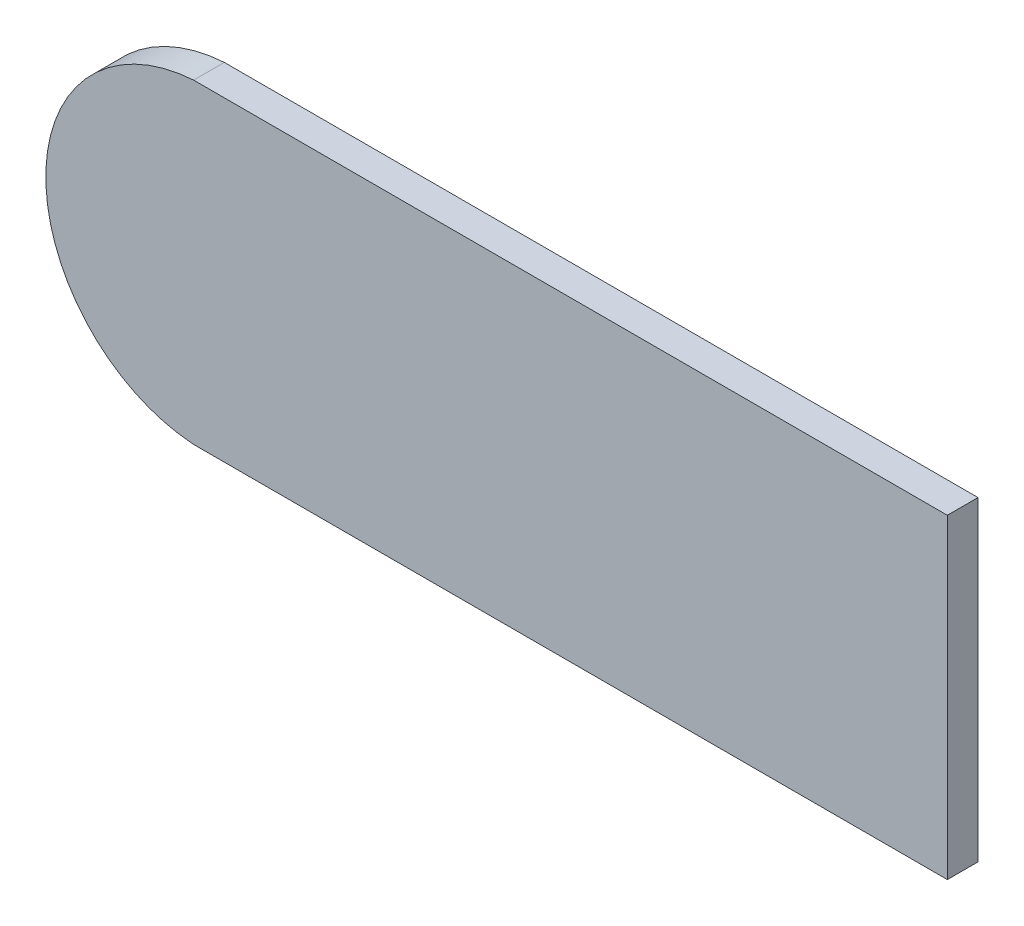
ISO-10303-21;
HEADER;
FILE_DESCRIPTION(('STEP AP214'),'2;1');
FILE_NAME('part.step','',(''),(''),'','','');
FILE_SCHEMA(('AUTOMOTIVE_DESIGN { 1 0 10303 214 1 1 1 1 }'));
ENDSEC;
DATA;
#1=APPLICATION_CONTEXT('core data for automotive mechanical design processes');
#2=APPLICATION_PROTOCOL_DEFINITION('international standard','automotive_design',2000,#1);
#3=PRODUCT_CONTEXT('',#1,'mechanical');
#4=PRODUCT('Part','Part','',(#3));
#5=PRODUCT_RELATED_PRODUCT_CATEGORY('part','',(#4));
#6=PRODUCT_DEFINITION_FORMATION('','',#4);
#7=PRODUCT_DEFINITION_CONTEXT('part definition',#1,'design');
#8=PRODUCT_DEFINITION('design','',#6,#7);
#9=PRODUCT_DEFINITION_SHAPE('','',#8);
#10=(LENGTH_UNIT() NAMED_UNIT(*) SI_UNIT(.MILLI.,.METRE.));
#11=(NAMED_UNIT(*) PLANE_ANGLE_UNIT() SI_UNIT($,.RADIAN.));
#12=(NAMED_UNIT(*) SI_UNIT($,.STERADIAN.) SOLID_ANGLE_UNIT());
#13=UNCERTAINTY_MEASURE_WITH_UNIT(LENGTH_MEASURE(1.E-05),#10,'distance_accuracy_value','');
#14=(GEOMETRIC_REPRESENTATION_CONTEXT(3) GLOBAL_UNCERTAINTY_ASSIGNED_CONTEXT((#13)) GLOBAL_UNIT_ASSIGNED_CONTEXT((#10,
#11,#12)) REPRESENTATION_CONTEXT('',''));
#15=CARTESIAN_POINT('',(0.,0.,0.));
#16=DIRECTION('',(0.,0.,1.));
#17=DIRECTION('',(1.,0.,0.));
#18=AXIS2_PLACEMENT_3D('',#15,#16,#17);
#19=CARTESIAN_POINT('',(-12.3042138671329,-1.03740541843096,-11.6632275560423));
#20=DIRECTION('',(0.,0.,1.));
#21=DIRECTION('',(0.,-1.,0.));
#22=AXIS2_PLACEMENT_3D('',#19,#20,#21);
#23=PLANE('',#22);
#24=CARTESIAN_POINT('',(17.7036516496222,-5.66575845870885,-11.6632275560423));
#25=DIRECTION('',(0.,0.,1.));
#26=DIRECTION('',(0.,-1.,0.));
#27=AXIS2_PLACEMENT_3D('',#24,#25,#26);
#28=CIRCLE('',#27,0.268070192302731);
#29=CARTESIAN_POINT('',(17.6862604965794,-5.39825298998519,-11.6632275560423));
#30=VERTEX_POINT('',#29);
#31=CARTESIAN_POINT('',(17.6862604965792,-5.9332639274325,-11.6632275560423));
#32=VERTEX_POINT('',#31);
#33=EDGE_CURVE('E19',#30,#32,#28,.T.);
#34=ORIENTED_EDGE('',*,*,#33,.F.);
#35=DIRECTION('',(-0.9999999999233,1.23854533594471E-05,0.));
#36=VECTOR('',#35,1.);
#37=CARTESIAN_POINT('',(17.6862604965794,-5.39825298998519,-11.6632275560423));
#38=LINE('',#37,#36);
#39=CARTESIAN_POINT('',(18.9641435629997,-5.39826881714631,-11.6632275560423));
#40=VERTEX_POINT('',#39);
#41=EDGE_CURVE('E57',#40,#30,#38,.T.);
#42=ORIENTED_EDGE('',*,*,#41,.F.);
#43=DIRECTION('',(0.,1.,0.));
#44=VECTOR('',#43,1.);
#45=CARTESIAN_POINT('',(18.9641435629997,-5.9332639274325,-11.6632275560423));
#46=LINE('',#45,#44);
#47=CARTESIAN_POINT('',(18.9641435629997,-5.9332639274325,-11.6632275560423));
#48=VERTEX_POINT('',#47);
#49=EDGE_CURVE('E73',#48,#40,#46,.T.);
#50=ORIENTED_EDGE('',*,*,#49,.F.);
#51=DIRECTION('',(1.,0.,0.));
#52=VECTOR('',#51,1.);
#53=CARTESIAN_POINT('',(18.9641435629997,-5.9332639274325,-11.6632275560423));
#54=LINE('',#53,#52);
#55=EDGE_CURVE('E59',#32,#48,#54,.T.);
#56=ORIENTED_EDGE('',*,*,#55,.F.);
#57=EDGE_LOOP('',(#34,#42,#50,#56));
#58=FACE_BOUND('',#57,.T.);
#59=ADVANCED_FACE('F16',(#58),#23,.F.);
#60=CARTESIAN_POINT('',(17.7036516496222,-5.66575845870885,-11.6112275560423));
#61=DIRECTION('',(0.,0.,1.));
#62=DIRECTION('',(0.,-1.,0.));
#63=AXIS2_PLACEMENT_3D('',#60,#61,#62);
#64=CYLINDRICAL_SURFACE('',#63,0.268070192302731);
#65=ORIENTED_EDGE('',*,*,#33,.T.);
#66=DIRECTION('',(0.,0.,1.));
#67=VECTOR('',#66,1.);
#68=CARTESIAN_POINT('',(17.6862604965793,-5.9332639274325,-11.6112275560423));
#69=LINE('',#68,#67);
#70=CARTESIAN_POINT('',(17.6862604965792,-5.9332639274325,-11.6112275560423));
#71=VERTEX_POINT('',#70);
#72=EDGE_CURVE('E82',#71,#32,#69,.F.);
#73=ORIENTED_EDGE('',*,*,#72,.F.);
#74=CARTESIAN_POINT('',(17.7036516496222,-5.66575845870885,-11.6112275560423));
#75=DIRECTION('',(0.,0.,1.));
#76=DIRECTION('',(0.,-1.,0.));
#77=AXIS2_PLACEMENT_3D('',#74,#75,#76);
#78=CIRCLE('',#77,0.268070192302731);
#79=CARTESIAN_POINT('',(17.6862604965794,-5.39825298998519,-11.6112275560423));
#80=VERTEX_POINT('',#79);
#81=EDGE_CURVE('E66',#80,#71,#78,.T.);
#82=ORIENTED_EDGE('',*,*,#81,.F.);
#83=DIRECTION('',(0.,0.,1.));
#84=VECTOR('',#83,1.);
#85=CARTESIAN_POINT('',(17.6862604965794,-5.39825298998519,-11.6112275560423));
#86=LINE('',#85,#84);
#87=EDGE_CURVE('E63',#30,#80,#86,.T.);
#88=ORIENTED_EDGE('',*,*,#87,.F.);
#89=EDGE_LOOP('',(#65,#73,#82,#88));
#90=FACE_BOUND('',#89,.T.);
#91=ADVANCED_FACE('F64',(#90),#64,.T.);
#92=CARTESIAN_POINT('',(18.9641435629997,-5.9332639274325,-11.6112275560423));
#93=DIRECTION('',(0.,-1.,0.));
#94=DIRECTION('',(1.,0.,0.));
#95=AXIS2_PLACEMENT_3D('',#92,#93,#94);
#96=PLANE('',#95);
#97=DIRECTION('',(1.,0.,0.));
#98=VECTOR('',#97,1.);
#99=CARTESIAN_POINT('',(-12.3042138671329,-5.9332639274325,-11.6112275560423));
#100=LINE('',#99,#98);
#101=CARTESIAN_POINT('',(18.9641435629997,-5.9332639274325,-11.6112275560423));
#102=VERTEX_POINT('',#101);
#103=EDGE_CURVE('E84',#71,#102,#100,.T.);
#104=ORIENTED_EDGE('',*,*,#103,.F.);
#105=ORIENTED_EDGE('',*,*,#72,.T.);
#106=ORIENTED_EDGE('',*,*,#55,.T.);
#107=DIRECTION('',(0.,0.,-1.));
#108=VECTOR('',#107,1.);
#109=CARTESIAN_POINT('',(18.9641435629997,-5.9332639274325,-11.6112275560423));
#110=LINE('',#109,#108);
#111=EDGE_CURVE('E70',#102,#48,#110,.T.);
#112=ORIENTED_EDGE('',*,*,#111,.F.);
#113=EDGE_LOOP('',(#104,#105,#106,#112));
#114=FACE_BOUND('',#113,.T.);
#115=ADVANCED_FACE('F102',(#114),#96,.T.);
#116=CARTESIAN_POINT('',(18.9641435629997,-5.9332639274325,-11.6112275560423));
#117=DIRECTION('',(1.,0.,0.));
#118=DIRECTION('',(0.,0.,-1.));
#119=AXIS2_PLACEMENT_3D('',#116,#117,#118);
#120=PLANE('',#119);
#121=DIRECTION('',(0.,-1.,0.));
#122=VECTOR('',#121,1.);
#123=CARTESIAN_POINT('',(18.9641435629997,-1.03740541843096,-11.6112275560423));
#124=LINE('',#123,#122);
#125=CARTESIAN_POINT('',(18.9641435629997,-5.3982688171463,-11.6112275560423));
#126=VERTEX_POINT('',#125);
#127=EDGE_CURVE('E25',#102,#126,#124,.F.);
#128=ORIENTED_EDGE('',*,*,#127,.F.);
#129=ORIENTED_EDGE('',*,*,#111,.T.);
#130=ORIENTED_EDGE('',*,*,#49,.T.);
#131=DIRECTION('',(0.,0.,1.));
#132=VECTOR('',#131,1.);
#133=CARTESIAN_POINT('',(18.9641435629997,-5.39826881714631,-11.6112275560423));
#134=LINE('',#133,#132);
#135=EDGE_CURVE('E34',#126,#40,#134,.F.);
#136=ORIENTED_EDGE('',*,*,#135,.F.);
#137=EDGE_LOOP('',(#128,#129,#130,#136));
#138=FACE_BOUND('',#137,.T.);
#139=ADVANCED_FACE('F99',(#138),#120,.T.);
#140=CARTESIAN_POINT('',(17.6862604965794,-5.39825298998519,-11.6112275560423));
#141=DIRECTION('',(1.23854533594471E-05,0.9999999999233,0.));
#142=DIRECTION('',(-0.9999999999233,1.23854533594471E-05,0.));
#143=AXIS2_PLACEMENT_3D('',#140,#141,#142);
#144=PLANE('',#143);
#145=DIRECTION('',(-0.9999999999233,1.23854533552443E-05,0.));
#146=VECTOR('',#145,1.);
#147=CARTESIAN_POINT('',(18.9641435629997,-5.3982688171463,-11.6112275560423));
#148=LINE('',#147,#146);
#149=EDGE_CURVE('E11',#126,#80,#148,.T.);
#150=ORIENTED_EDGE('',*,*,#149,.F.);
#151=ORIENTED_EDGE('',*,*,#135,.T.);
#152=ORIENTED_EDGE('',*,*,#41,.T.);
#153=ORIENTED_EDGE('',*,*,#87,.T.);
#154=EDGE_LOOP('',(#150,#151,#152,#153));
#155=FACE_BOUND('',#154,.T.);
#156=ADVANCED_FACE('F69',(#155),#144,.T.);
#157=CARTESIAN_POINT('',(-12.3042138671329,-1.03740541843096,-11.6112275560423));
#158=DIRECTION('',(0.,0.,1.));
#159=DIRECTION('',(0.,-1.,0.));
#160=AXIS2_PLACEMENT_3D('',#157,#158,#159);
#161=PLANE('',#160);
#162=ORIENTED_EDGE('',*,*,#127,.T.);
#163=ORIENTED_EDGE('',*,*,#149,.T.);
#164=ORIENTED_EDGE('',*,*,#81,.T.);
#165=ORIENTED_EDGE('',*,*,#103,.T.);
#166=EDGE_LOOP('',(#162,#163,#164,#165));
#167=FACE_BOUND('',#166,.T.);
#168=ADVANCED_FACE('F103',(#167),#161,.T.);
#169=CLOSED_SHELL('',(#59,#91,#115,#139,#156,#168));
#170=MANIFOLD_SOLID_BREP('B1',#169);
#171=ADVANCED_BREP_SHAPE_REPRESENTATION('',(#18,#170),#14);
#172=SHAPE_DEFINITION_REPRESENTATION(#9,#171);
ENDSEC;
END-ISO-10303-21;
